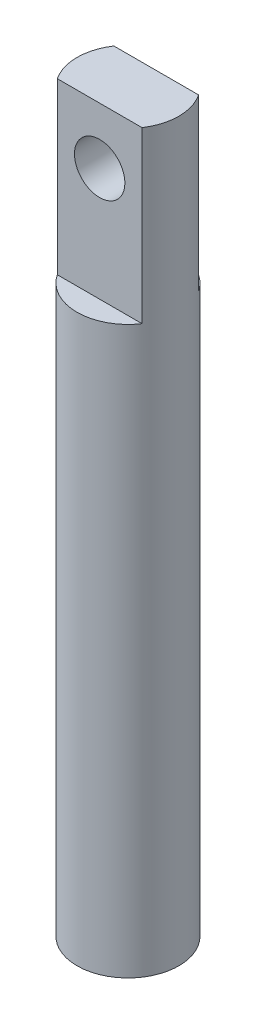
ISO-10303-21;
HEADER;
FILE_DESCRIPTION(('STEP AP214'),'2;1');
FILE_NAME('part.step','',(''),(''),'','','');
FILE_SCHEMA(('AUTOMOTIVE_DESIGN { 1 0 10303 214 1 1 1 1 }'));
ENDSEC;
DATA;
#1=APPLICATION_CONTEXT('core data for automotive mechanical design processes');
#2=APPLICATION_PROTOCOL_DEFINITION('international standard','automotive_design',2000,#1);
#3=PRODUCT_CONTEXT('',#1,'mechanical');
#4=PRODUCT('Part','Part','',(#3));
#5=PRODUCT_RELATED_PRODUCT_CATEGORY('part','',(#4));
#6=PRODUCT_DEFINITION_FORMATION('','',#4);
#7=PRODUCT_DEFINITION_CONTEXT('part definition',#1,'design');
#8=PRODUCT_DEFINITION('design','',#6,#7);
#9=PRODUCT_DEFINITION_SHAPE('','',#8);
#10=(LENGTH_UNIT() NAMED_UNIT(*) SI_UNIT(.MILLI.,.METRE.));
#11=(NAMED_UNIT(*) PLANE_ANGLE_UNIT() SI_UNIT($,.RADIAN.));
#12=(NAMED_UNIT(*) SI_UNIT($,.STERADIAN.) SOLID_ANGLE_UNIT());
#13=UNCERTAINTY_MEASURE_WITH_UNIT(LENGTH_MEASURE(1.E-05),#10,'distance_accuracy_value','');
#14=(GEOMETRIC_REPRESENTATION_CONTEXT(3) GLOBAL_UNCERTAINTY_ASSIGNED_CONTEXT((#13)) GLOBAL_UNIT_ASSIGNED_CONTEXT((#10,
#11,#12)) REPRESENTATION_CONTEXT('',''));
#15=CARTESIAN_POINT('',(0.,0.,0.));
#16=DIRECTION('',(0.,0.,1.));
#17=DIRECTION('',(1.,0.,0.));
#18=AXIS2_PLACEMENT_3D('',#15,#16,#17);
#19=CARTESIAN_POINT('',(0.,25.4,0.));
#20=DIRECTION('',(0.,1.,0.));
#21=DIRECTION('',(0.,0.,1.));
#22=AXIS2_PLACEMENT_3D('',#19,#20,#21);
#23=PLANE('',#22);
#24=DIRECTION('',(-1.,0.,0.));
#25=VECTOR('',#24,1.);
#26=CARTESIAN_POINT('',(-2.286,25.4,-1.27));
#27=LINE('',#26,#25);
#28=CARTESIAN_POINT('',(1.90076195248116,25.4,-1.27));
#29=VERTEX_POINT('',#28);
#30=CARTESIAN_POINT('',(-1.90076195248116,25.4,-1.27));
#31=VERTEX_POINT('',#30);
#32=EDGE_CURVE('E84',#29,#31,#27,.T.);
#33=ORIENTED_EDGE('',*,*,#32,.F.);
#34=CARTESIAN_POINT('',(0.,25.4,0.));
#35=DIRECTION('',(0.,1.,0.));
#36=DIRECTION('',(0.,0.,1.));
#37=AXIS2_PLACEMENT_3D('',#34,#35,#36);
#38=CIRCLE('',#37,2.286);
#39=EDGE_CURVE('E99',#29,#31,#38,.T.);
#40=ORIENTED_EDGE('',*,*,#39,.T.);
#41=EDGE_LOOP('',(#33,#40));
#42=FACE_BOUND('',#41,.T.);
#43=ADVANCED_FACE('F33',(#42),#23,.T.);
#44=CARTESIAN_POINT('',(0.,25.4,0.));
#45=DIRECTION('',(0.,-1.,0.));
#46=DIRECTION('',(0.,0.,-1.));
#47=AXIS2_PLACEMENT_3D('',#44,#45,#46);
#48=CYLINDRICAL_SURFACE('',#47,2.286);
#49=DIRECTION('',(0.,-1.,0.));
#50=VECTOR('',#49,1.);
#51=CARTESIAN_POINT('',(1.90076195248116,33.02,1.27));
#52=LINE('',#51,#50);
#53=CARTESIAN_POINT('',(1.90076195248116,25.4,1.27));
#54=VERTEX_POINT('',#53);
#55=CARTESIAN_POINT('',(1.90076195248116,33.02,1.27));
#56=VERTEX_POINT('',#55);
#57=EDGE_CURVE('E77',#54,#56,#52,.F.);
#58=ORIENTED_EDGE('',*,*,#57,.F.);
#59=CARTESIAN_POINT('',(-1.90076195248116,25.4,1.27));
#60=VERTEX_POINT('',#59);
#61=EDGE_CURVE('E98',#60,#54,#38,.T.);
#62=ORIENTED_EDGE('',*,*,#61,.F.);
#63=DIRECTION('',(0.,-1.,0.));
#64=VECTOR('',#63,1.);
#65=CARTESIAN_POINT('',(-1.90076195248116,33.02,1.27));
#66=LINE('',#65,#64);
#67=CARTESIAN_POINT('',(-1.90076195248116,33.02,1.27));
#68=VERTEX_POINT('',#67);
#69=EDGE_CURVE('E48',#68,#60,#66,.T.);
#70=ORIENTED_EDGE('',*,*,#69,.F.);
#71=CARTESIAN_POINT('',(0.,33.02,0.));
#72=DIRECTION('',(0.,1.,0.));
#73=DIRECTION('',(0.,0.,1.));
#74=AXIS2_PLACEMENT_3D('',#71,#72,#73);
#75=CIRCLE('',#74,2.286);
#76=CARTESIAN_POINT('',(-1.90076195248116,33.02,-1.27));
#77=VERTEX_POINT('',#76);
#78=EDGE_CURVE('E12',#68,#77,#75,.F.);
#79=ORIENTED_EDGE('',*,*,#78,.T.);
#80=DIRECTION('',(0.,-1.,0.));
#81=VECTOR('',#80,1.);
#82=CARTESIAN_POINT('',(-1.90076195248116,33.02,-1.27));
#83=LINE('',#82,#81);
#84=EDGE_CURVE('E55',#31,#77,#83,.F.);
#85=ORIENTED_EDGE('',*,*,#84,.F.);
#86=ORIENTED_EDGE('',*,*,#39,.F.);
#87=DIRECTION('',(0.,-1.,0.));
#88=VECTOR('',#87,1.);
#89=CARTESIAN_POINT('',(1.90076195248116,33.02,-1.27));
#90=LINE('',#89,#88);
#91=CARTESIAN_POINT('',(1.90076195248116,33.02,-1.27));
#92=VERTEX_POINT('',#91);
#93=EDGE_CURVE('E79',#92,#29,#90,.T.);
#94=ORIENTED_EDGE('',*,*,#93,.F.);
#95=EDGE_CURVE('E41',#92,#56,#75,.F.);
#96=ORIENTED_EDGE('',*,*,#95,.T.);
#97=EDGE_LOOP('',(#58,#62,#70,#79,#85,#86,#94,#96));
#98=FACE_BOUND('',#97,.T.);
#99=CARTESIAN_POINT('',(0.,0.,0.));
#100=DIRECTION('',(0.,1.,0.));
#101=DIRECTION('',(0.,0.,1.));
#102=AXIS2_PLACEMENT_3D('',#99,#100,#101);
#103=CIRCLE('',#102,2.286);
#104=CARTESIAN_POINT('',(0.,0.,2.286));
#105=VERTEX_POINT('',#104);
#106=EDGE_CURVE('E92',#105,#105,#103,.T.);
#107=ORIENTED_EDGE('',*,*,#106,.T.);
#108=EDGE_LOOP('',(#107));
#109=FACE_BOUND('',#108,.T.);
#110=ADVANCED_FACE('F35',(#98,#109),#48,.T.);
#111=DIRECTION('',(1.,0.,0.));
#112=VECTOR('',#111,1.);
#113=CARTESIAN_POINT('',(-2.286,25.4,1.27));
#114=LINE('',#113,#112);
#115=EDGE_CURVE('E87',#60,#54,#114,.T.);
#116=ORIENTED_EDGE('',*,*,#115,.F.);
#117=ORIENTED_EDGE('',*,*,#61,.T.);
#118=EDGE_LOOP('',(#116,#117));
#119=FACE_BOUND('',#118,.T.);
#120=ADVANCED_FACE('F123',(#119),#23,.T.);
#121=CARTESIAN_POINT('',(0.,0.,0.));
#122=DIRECTION('',(0.,1.,0.));
#123=DIRECTION('',(0.,0.,1.));
#124=AXIS2_PLACEMENT_3D('',#121,#122,#123);
#125=PLANE('',#124);
#126=ORIENTED_EDGE('',*,*,#106,.F.);
#127=EDGE_LOOP('',(#126));
#128=FACE_BOUND('',#127,.T.);
#129=ADVANCED_FACE('F129',(#128),#125,.F.);
#130=CARTESIAN_POINT('',(-2.286,33.02,1.27));
#131=DIRECTION('',(0.,0.,-1.));
#132=DIRECTION('',(-1.,0.,0.));
#133=AXIS2_PLACEMENT_3D('',#130,#131,#132);
#134=PLANE('',#133);
#135=CARTESIAN_POINT('',(-5.75188382166691E-08,30.48,1.27));
#136=DIRECTION('',(0.,0.,-1.));
#137=DIRECTION('',(-1.,0.,0.));
#138=AXIS2_PLACEMENT_3D('',#135,#136,#137);
#139=CIRCLE('',#138,1.1303);
#140=CARTESIAN_POINT('',(-1.13030005751884,30.48,1.27));
#141=VERTEX_POINT('',#140);
#142=EDGE_CURVE('E108',#141,#141,#139,.T.);
#143=ORIENTED_EDGE('',*,*,#142,.T.);
#144=EDGE_LOOP('',(#143));
#145=FACE_BOUND('',#144,.T.);
#146=ORIENTED_EDGE('',*,*,#115,.T.);
#147=ORIENTED_EDGE('',*,*,#57,.T.);
#148=DIRECTION('',(1.,0.,0.));
#149=VECTOR('',#148,1.);
#150=CARTESIAN_POINT('',(-2.286,33.02,1.27));
#151=LINE('',#150,#149);
#152=EDGE_CURVE('E86',#68,#56,#151,.T.);
#153=ORIENTED_EDGE('',*,*,#152,.F.);
#154=ORIENTED_EDGE('',*,*,#69,.T.);
#155=EDGE_LOOP('',(#146,#147,#153,#154));
#156=FACE_BOUND('',#155,.T.);
#157=ADVANCED_FACE('F85',(#145,#156),#134,.F.);
#158=CARTESIAN_POINT('',(-2.286,33.02,-1.27));
#159=DIRECTION('',(0.,0.,1.));
#160=DIRECTION('',(1.,0.,0.));
#161=AXIS2_PLACEMENT_3D('',#158,#159,#160);
#162=PLANE('',#161);
#163=CARTESIAN_POINT('',(-5.75188382166691E-08,30.48,-1.27));
#164=DIRECTION('',(0.,0.,-1.));
#165=DIRECTION('',(-1.,0.,0.));
#166=AXIS2_PLACEMENT_3D('',#163,#164,#165);
#167=CIRCLE('',#166,1.1303);
#168=CARTESIAN_POINT('',(-1.13030005751884,30.48,-1.27));
#169=VERTEX_POINT('',#168);
#170=EDGE_CURVE('E111',#169,#169,#167,.T.);
#171=ORIENTED_EDGE('',*,*,#170,.F.);
#172=EDGE_LOOP('',(#171));
#173=FACE_BOUND('',#172,.T.);
#174=ORIENTED_EDGE('',*,*,#32,.T.);
#175=ORIENTED_EDGE('',*,*,#84,.T.);
#176=DIRECTION('',(-1.,0.,0.));
#177=VECTOR('',#176,1.);
#178=CARTESIAN_POINT('',(-2.286,33.02,-1.27));
#179=LINE('',#178,#177);
#180=EDGE_CURVE('E90',#92,#77,#179,.T.);
#181=ORIENTED_EDGE('',*,*,#180,.F.);
#182=ORIENTED_EDGE('',*,*,#93,.T.);
#183=EDGE_LOOP('',(#174,#175,#181,#182));
#184=FACE_BOUND('',#183,.T.);
#185=ADVANCED_FACE('F118',(#173,#184),#162,.F.);
#186=CARTESIAN_POINT('',(-2.286,33.02,1.27));
#187=DIRECTION('',(0.,1.,0.));
#188=DIRECTION('',(0.,0.,1.));
#189=AXIS2_PLACEMENT_3D('',#186,#187,#188);
#190=PLANE('',#189);
#191=ORIENTED_EDGE('',*,*,#78,.F.);
#192=ORIENTED_EDGE('',*,*,#152,.T.);
#193=ORIENTED_EDGE('',*,*,#95,.F.);
#194=ORIENTED_EDGE('',*,*,#180,.T.);
#195=EDGE_LOOP('',(#191,#192,#193,#194));
#196=FACE_BOUND('',#195,.T.);
#197=ADVANCED_FACE('F89',(#196),#190,.T.);
#198=CARTESIAN_POINT('',(-5.75188382166691E-08,30.48,-1.27));
#199=DIRECTION('',(0.,0.,-1.));
#200=DIRECTION('',(-1.,0.,0.));
#201=AXIS2_PLACEMENT_3D('',#198,#199,#200);
#202=CYLINDRICAL_SURFACE('',#201,1.1303);
#203=ORIENTED_EDGE('',*,*,#170,.T.);
#204=EDGE_LOOP('',(#203));
#205=FACE_BOUND('',#204,.T.);
#206=ORIENTED_EDGE('',*,*,#142,.F.);
#207=EDGE_LOOP('',(#206));
#208=FACE_BOUND('',#207,.T.);
#209=ADVANCED_FACE('F115',(#205,#208),#202,.F.);
#210=CLOSED_SHELL('',(#43,#110,#120,#129,#157,#185,#197,#209));
#211=MANIFOLD_SOLID_BREP('B2',#210);
#212=ADVANCED_BREP_SHAPE_REPRESENTATION('',(#18,#211),#14);
#213=SHAPE_DEFINITION_REPRESENTATION(#9,#212);
ENDSEC;
END-ISO-10303-21;
